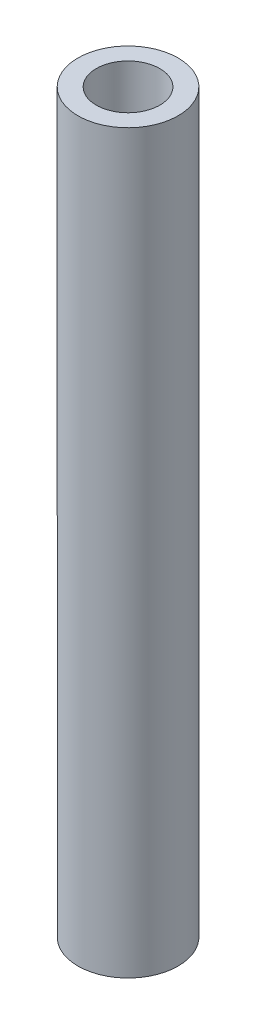
ISO-10303-21;
HEADER;
FILE_DESCRIPTION(('STEP AP214'),'2;1');
FILE_NAME('part.step','',(''),(''),'','','');
FILE_SCHEMA(('AUTOMOTIVE_DESIGN { 1 0 10303 214 1 1 1 1 }'));
ENDSEC;
DATA;
#1=APPLICATION_CONTEXT('core data for automotive mechanical design processes');
#2=APPLICATION_PROTOCOL_DEFINITION('international standard','automotive_design',2000,#1);
#3=PRODUCT_CONTEXT('',#1,'mechanical');
#4=PRODUCT('Part','Part','',(#3));
#5=PRODUCT_RELATED_PRODUCT_CATEGORY('part','',(#4));
#6=PRODUCT_DEFINITION_FORMATION('','',#4);
#7=PRODUCT_DEFINITION_CONTEXT('part definition',#1,'design');
#8=PRODUCT_DEFINITION('design','',#6,#7);
#9=PRODUCT_DEFINITION_SHAPE('','',#8);
#10=(LENGTH_UNIT() NAMED_UNIT(*) SI_UNIT(.MILLI.,.METRE.));
#11=(NAMED_UNIT(*) PLANE_ANGLE_UNIT() SI_UNIT($,.RADIAN.));
#12=(NAMED_UNIT(*) SI_UNIT($,.STERADIAN.) SOLID_ANGLE_UNIT());
#13=UNCERTAINTY_MEASURE_WITH_UNIT(LENGTH_MEASURE(1.E-05),#10,'distance_accuracy_value','');
#14=(GEOMETRIC_REPRESENTATION_CONTEXT(3) GLOBAL_UNCERTAINTY_ASSIGNED_CONTEXT((#13)) GLOBAL_UNIT_ASSIGNED_CONTEXT((#10,
#11,#12)) REPRESENTATION_CONTEXT('',''));
#15=CARTESIAN_POINT('',(0.,0.,0.));
#16=DIRECTION('',(0.,0.,1.));
#17=DIRECTION('',(1.,0.,0.));
#18=AXIS2_PLACEMENT_3D('',#15,#16,#17);
#19=CARTESIAN_POINT('',(0.,-65.,0.));
#20=DIRECTION('',(0.,1.,0.));
#21=DIRECTION('',(0.,0.,1.));
#22=AXIS2_PLACEMENT_3D('',#19,#20,#21);
#23=PLANE('',#22);
#24=CARTESIAN_POINT('',(0.,-65.,0.));
#25=DIRECTION('',(0.,1.,0.));
#26=DIRECTION('',(0.,0.,1.));
#27=AXIS2_PLACEMENT_3D('',#24,#25,#26);
#28=CIRCLE('',#27,4.7625);
#29=CARTESIAN_POINT('',(0.,-65.,4.7625));
#30=VERTEX_POINT('',#29);
#31=EDGE_CURVE('E10',#30,#30,#28,.T.);
#32=ORIENTED_EDGE('',*,*,#31,.F.);
#33=EDGE_LOOP('',(#32));
#34=FACE_BOUND('',#33,.T.);
#35=CARTESIAN_POINT('',(0.,-65.,0.));
#36=DIRECTION('',(0.,1.,0.));
#37=DIRECTION('',(0.,0.,1.));
#38=AXIS2_PLACEMENT_3D('',#35,#36,#37);
#39=CIRCLE('',#38,3.01897649096245);
#40=CARTESIAN_POINT('',(0.,-65.,3.01897649096245));
#41=VERTEX_POINT('',#40);
#42=EDGE_CURVE('E38',#41,#41,#39,.T.);
#43=ORIENTED_EDGE('',*,*,#42,.T.);
#44=EDGE_LOOP('',(#43));
#45=FACE_BOUND('',#44,.T.);
#46=ADVANCED_FACE('F30',(#34,#45),#23,.F.);
#47=CARTESIAN_POINT('',(0.,65.,0.));
#48=DIRECTION('',(0.,-1.,0.));
#49=DIRECTION('',(0.,0.,-1.));
#50=AXIS2_PLACEMENT_3D('',#47,#48,#49);
#51=CYLINDRICAL_SURFACE('',#50,4.7625);
#52=CARTESIAN_POINT('',(0.,5.,0.));
#53=DIRECTION('',(0.,-1.,0.));
#54=DIRECTION('',(0.,0.,-1.));
#55=AXIS2_PLACEMENT_3D('',#52,#53,#54);
#56=CIRCLE('',#55,4.7625);
#57=CARTESIAN_POINT('',(0.,5.00000000000001,-4.7625));
#58=VERTEX_POINT('',#57);
#59=EDGE_CURVE('E42',#58,#58,#56,.T.);
#60=ORIENTED_EDGE('',*,*,#59,.T.);
#61=EDGE_LOOP('',(#60));
#62=FACE_BOUND('',#61,.T.);
#63=ORIENTED_EDGE('',*,*,#31,.T.);
#64=EDGE_LOOP('',(#63));
#65=FACE_BOUND('',#64,.T.);
#66=ADVANCED_FACE('F32',(#62,#65),#51,.T.);
#67=CARTESIAN_POINT('',(0.,65.,0.));
#68=DIRECTION('',(0.,-1.,0.));
#69=DIRECTION('',(0.,0.,-1.));
#70=AXIS2_PLACEMENT_3D('',#67,#68,#69);
#71=CYLINDRICAL_SURFACE('',#70,3.01897649096245);
#72=CARTESIAN_POINT('',(0.,5.,0.));
#73=DIRECTION('',(0.,-1.,0.));
#74=DIRECTION('',(0.,0.,-1.));
#75=AXIS2_PLACEMENT_3D('',#72,#73,#74);
#76=CIRCLE('',#75,3.01897649096245);
#77=CARTESIAN_POINT('',(0.,5.,-3.01897649096245));
#78=VERTEX_POINT('',#77);
#79=EDGE_CURVE('E34',#78,#78,#76,.T.);
#80=ORIENTED_EDGE('',*,*,#79,.F.);
#81=EDGE_LOOP('',(#80));
#82=FACE_BOUND('',#81,.T.);
#83=ORIENTED_EDGE('',*,*,#42,.F.);
#84=EDGE_LOOP('',(#83));
#85=FACE_BOUND('',#84,.T.);
#86=ADVANCED_FACE('F54',(#82,#85),#71,.F.);
#87=CARTESIAN_POINT('',(-4.7625,5.,-15.5590167069306));
#88=DIRECTION('',(0.,-1.,0.));
#89=DIRECTION('',(0.,0.,-1.));
#90=AXIS2_PLACEMENT_3D('',#87,#88,#89);
#91=PLANE('',#90);
#92=ORIENTED_EDGE('',*,*,#79,.T.);
#93=EDGE_LOOP('',(#92));
#94=FACE_BOUND('',#93,.T.);
#95=ORIENTED_EDGE('',*,*,#59,.F.);
#96=EDGE_LOOP('',(#95));
#97=FACE_BOUND('',#96,.T.);
#98=ADVANCED_FACE('F51',(#94,#97),#91,.F.);
#99=CLOSED_SHELL('',(#46,#66,#86,#98));
#100=MANIFOLD_SOLID_BREP('B2',#99);
#101=ADVANCED_BREP_SHAPE_REPRESENTATION('',(#18,#100),#14);
#102=SHAPE_DEFINITION_REPRESENTATION(#9,#101);
ENDSEC;
END-ISO-10303-21;
